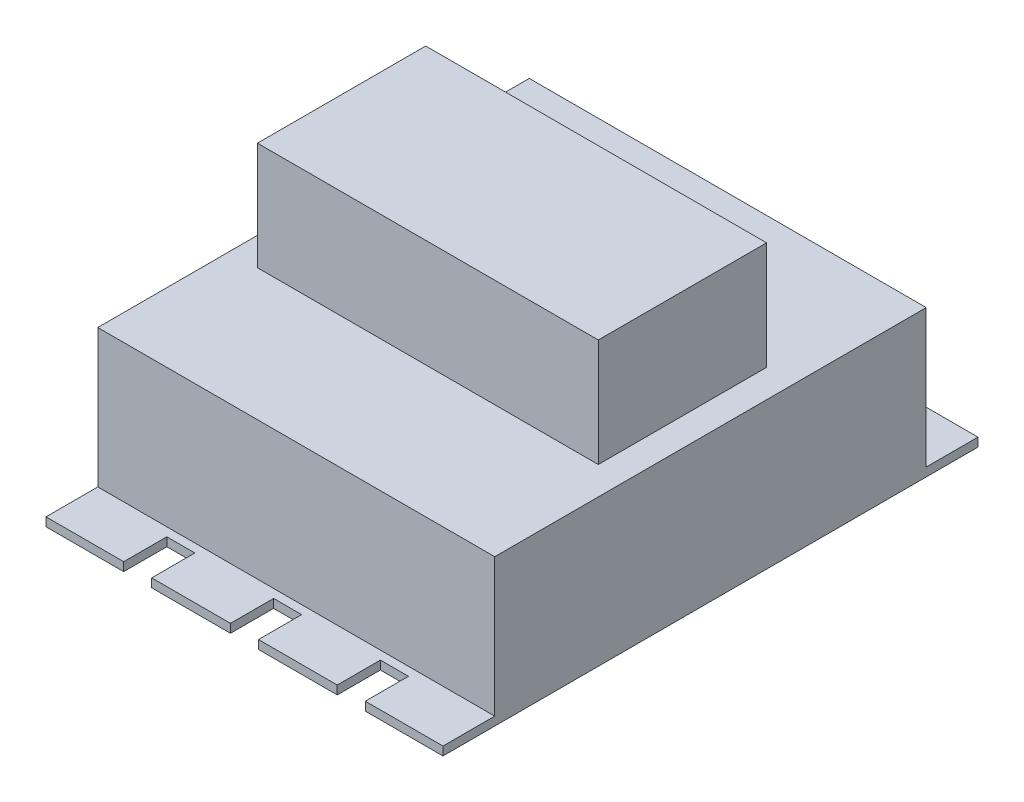
ISO-10303-21;
HEADER;
FILE_DESCRIPTION(('STEP AP214'),'2;1');
FILE_NAME('part.step','',(''),(''),'','','');
FILE_SCHEMA(('AUTOMOTIVE_DESIGN { 1 0 10303 214 1 1 1 1 }'));
ENDSEC;
DATA;
#1=APPLICATION_CONTEXT('core data for automotive mechanical design processes');
#2=APPLICATION_PROTOCOL_DEFINITION('international standard','automotive_design',2000,#1);
#3=PRODUCT_CONTEXT('',#1,'mechanical');
#4=PRODUCT('Part','Part','',(#3));
#5=PRODUCT_RELATED_PRODUCT_CATEGORY('part','',(#4));
#6=PRODUCT_DEFINITION_FORMATION('','',#4);
#7=PRODUCT_DEFINITION_CONTEXT('part definition',#1,'design');
#8=PRODUCT_DEFINITION('design','',#6,#7);
#9=PRODUCT_DEFINITION_SHAPE('','',#8);
#10=(LENGTH_UNIT() NAMED_UNIT(*) SI_UNIT(.MILLI.,.METRE.));
#11=(NAMED_UNIT(*) PLANE_ANGLE_UNIT() SI_UNIT($,.RADIAN.));
#12=(NAMED_UNIT(*) SI_UNIT($,.STERADIAN.) SOLID_ANGLE_UNIT());
#13=UNCERTAINTY_MEASURE_WITH_UNIT(LENGTH_MEASURE(1.E-05),#10,'distance_accuracy_value','');
#14=(GEOMETRIC_REPRESENTATION_CONTEXT(3) GLOBAL_UNCERTAINTY_ASSIGNED_CONTEXT((#13)) GLOBAL_UNIT_ASSIGNED_CONTEXT((#10,
#11,#12)) REPRESENTATION_CONTEXT('',''));
#15=CARTESIAN_POINT('',(0.,0.,0.));
#16=DIRECTION('',(0.,0.,1.));
#17=DIRECTION('',(1.,0.,0.));
#18=AXIS2_PLACEMENT_3D('',#15,#16,#17);
#19=CARTESIAN_POINT('',(0.,34.,0.));
#20=DIRECTION('',(0.,0.,-1.));
#21=DIRECTION('',(-1.,0.,0.));
#22=AXIS2_PLACEMENT_3D('',#19,#20,#21);
#23=PLANE('',#22);
#24=DIRECTION('',(-1.,0.,0.));
#25=VECTOR('',#24,1.);
#26=CARTESIAN_POINT('',(0.,2.,0.));
#27=LINE('',#26,#25);
#28=CARTESIAN_POINT('',(92.,2.,0.));
#29=VERTEX_POINT('',#28);
#30=CARTESIAN_POINT('',(0.,2.,0.));
#31=VERTEX_POINT('',#30);
#32=EDGE_CURVE('E52',#29,#31,#27,.T.);
#33=ORIENTED_EDGE('',*,*,#32,.F.);
#34=DIRECTION('',(0.,-1.,0.));
#35=VECTOR('',#34,1.);
#36=CARTESIAN_POINT('',(92.,34.,0.));
#37=LINE('',#36,#35);
#38=CARTESIAN_POINT('',(92.,34.,0.));
#39=VERTEX_POINT('',#38);
#40=EDGE_CURVE('E552',#39,#29,#37,.T.);
#41=ORIENTED_EDGE('',*,*,#40,.F.);
#42=DIRECTION('',(1.,0.,0.));
#43=VECTOR('',#42,1.);
#44=CARTESIAN_POINT('',(0.,34.,0.));
#45=LINE('',#44,#43);
#46=CARTESIAN_POINT('',(0.,34.,0.));
#47=VERTEX_POINT('',#46);
#48=EDGE_CURVE('E540',#47,#39,#45,.T.);
#49=ORIENTED_EDGE('',*,*,#48,.F.);
#50=DIRECTION('',(0.,-1.,0.));
#51=VECTOR('',#50,1.);
#52=CARTESIAN_POINT('',(0.,34.,0.));
#53=LINE('',#52,#51);
#54=EDGE_CURVE('E42',#47,#31,#53,.T.);
#55=ORIENTED_EDGE('',*,*,#54,.T.);
#56=EDGE_LOOP('',(#33,#41,#49,#55));
#57=FACE_BOUND('',#56,.T.);
#58=ADVANCED_FACE('F34',(#57),#23,.F.);
#59=CARTESIAN_POINT('',(0.,34.,-100.));
#60=DIRECTION('',(0.,0.,1.));
#61=DIRECTION('',(1.,0.,0.));
#62=AXIS2_PLACEMENT_3D('',#59,#60,#61);
#63=PLANE('',#62);
#64=DIRECTION('',(1.,0.,0.));
#65=VECTOR('',#64,1.);
#66=CARTESIAN_POINT('',(0.,2.,-100.));
#67=LINE('',#66,#65);
#68=CARTESIAN_POINT('',(0.,2.,-100.));
#69=VERTEX_POINT('',#68);
#70=CARTESIAN_POINT('',(92.,2.,-100.));
#71=VERTEX_POINT('',#70);
#72=EDGE_CURVE('E11',#69,#71,#67,.T.);
#73=ORIENTED_EDGE('',*,*,#72,.F.);
#74=DIRECTION('',(0.,-1.,0.));
#75=VECTOR('',#74,1.);
#76=CARTESIAN_POINT('',(0.,34.,-100.));
#77=LINE('',#76,#75);
#78=CARTESIAN_POINT('',(0.,34.,-100.));
#79=VERTEX_POINT('',#78);
#80=EDGE_CURVE('E272',#79,#69,#77,.T.);
#81=ORIENTED_EDGE('',*,*,#80,.F.);
#82=DIRECTION('',(-1.,0.,0.));
#83=VECTOR('',#82,1.);
#84=CARTESIAN_POINT('',(0.,34.,-100.));
#85=LINE('',#84,#83);
#86=CARTESIAN_POINT('',(92.,34.,-100.));
#87=VERTEX_POINT('',#86);
#88=EDGE_CURVE('E545',#87,#79,#85,.T.);
#89=ORIENTED_EDGE('',*,*,#88,.F.);
#90=DIRECTION('',(0.,-1.,0.));
#91=VECTOR('',#90,1.);
#92=CARTESIAN_POINT('',(92.,34.,-100.));
#93=LINE('',#92,#91);
#94=EDGE_CURVE('E550',#87,#71,#93,.T.);
#95=ORIENTED_EDGE('',*,*,#94,.T.);
#96=EDGE_LOOP('',(#73,#81,#89,#95));
#97=FACE_BOUND('',#96,.T.);
#98=ADVANCED_FACE('F584',(#97),#63,.F.);
#99=CARTESIAN_POINT('',(0.,34.,0.));
#100=DIRECTION('',(0.,-1.,0.));
#101=DIRECTION('',(0.,0.,-1.));
#102=AXIS2_PLACEMENT_3D('',#99,#100,#101);
#103=PLANE('',#102);
#104=DIRECTION('',(0.,0.,1.));
#105=VECTOR('',#104,1.);
#106=CARTESIAN_POINT('',(0.,34.,0.));
#107=LINE('',#106,#105);
#108=EDGE_CURVE('E537',#79,#47,#107,.T.);
#109=ORIENTED_EDGE('',*,*,#108,.T.);
#110=ORIENTED_EDGE('',*,*,#48,.T.);
#111=DIRECTION('',(0.,0.,-1.));
#112=VECTOR('',#111,1.);
#113=CARTESIAN_POINT('',(92.,34.,0.));
#114=LINE('',#113,#112);
#115=EDGE_CURVE('E543',#39,#87,#114,.T.);
#116=ORIENTED_EDGE('',*,*,#115,.T.);
#117=ORIENTED_EDGE('',*,*,#88,.T.);
#118=EDGE_LOOP('',(#109,#110,#116,#117));
#119=FACE_BOUND('',#118,.T.);
#120=DIRECTION('',(0.,0.,1.));
#121=VECTOR('',#120,1.);
#122=CARTESIAN_POINT('',(6.50000000000001,34.,-69.5));
#123=LINE('',#122,#121);
#124=CARTESIAN_POINT('',(6.50000000000001,34.,-69.5));
#125=VERTEX_POINT('',#124);
#126=CARTESIAN_POINT('',(6.50000000000001,34.,-30.5));
#127=VERTEX_POINT('',#126);
#128=EDGE_CURVE('E503',#125,#127,#123,.T.);
#129=ORIENTED_EDGE('',*,*,#128,.F.);
#130=DIRECTION('',(-1.,0.,0.));
#131=VECTOR('',#130,1.);
#132=CARTESIAN_POINT('',(6.50000000000001,34.,-69.5));
#133=LINE('',#132,#131);
#134=CARTESIAN_POINT('',(85.5,34.,-69.5));
#135=VERTEX_POINT('',#134);
#136=EDGE_CURVE('E508',#135,#125,#133,.T.);
#137=ORIENTED_EDGE('',*,*,#136,.F.);
#138=DIRECTION('',(0.,0.,-1.));
#139=VECTOR('',#138,1.);
#140=CARTESIAN_POINT('',(85.5,34.,-69.5));
#141=LINE('',#140,#139);
#142=CARTESIAN_POINT('',(85.5,34.,-30.5));
#143=VERTEX_POINT('',#142);
#144=EDGE_CURVE('E520',#143,#135,#141,.T.);
#145=ORIENTED_EDGE('',*,*,#144,.F.);
#146=DIRECTION('',(1.,0.,0.));
#147=VECTOR('',#146,1.);
#148=CARTESIAN_POINT('',(6.50000000000001,34.,-30.5));
#149=LINE('',#148,#147);
#150=EDGE_CURVE('E517',#127,#143,#149,.T.);
#151=ORIENTED_EDGE('',*,*,#150,.F.);
#152=EDGE_LOOP('',(#129,#137,#145,#151));
#153=FACE_BOUND('',#152,.T.);
#154=ADVANCED_FACE('F586',(#119,#153),#103,.F.);
#155=CARTESIAN_POINT('',(0.,34.,0.));
#156=DIRECTION('',(1.,0.,0.));
#157=DIRECTION('',(0.,0.,-1.));
#158=AXIS2_PLACEMENT_3D('',#155,#156,#157);
#159=PLANE('',#158);
#160=DIRECTION('',(0.,0.,1.));
#161=VECTOR('',#160,1.);
#162=CARTESIAN_POINT('',(0.,0.,0.));
#163=LINE('',#162,#161);
#164=CARTESIAN_POINT('',(0.,0.,-112.));
#165=VERTEX_POINT('',#164);
#166=CARTESIAN_POINT('',(0.,0.,12.));
#167=VERTEX_POINT('',#166);
#168=EDGE_CURVE('E536',#165,#167,#163,.T.);
#169=ORIENTED_EDGE('',*,*,#168,.T.);
#170=DIRECTION('',(0.,-1.,0.));
#171=VECTOR('',#170,1.);
#172=CARTESIAN_POINT('',(0.,2.,12.));
#173=LINE('',#172,#171);
#174=CARTESIAN_POINT('',(0.,2.,12.));
#175=VERTEX_POINT('',#174);
#176=EDGE_CURVE('E446',#175,#167,#173,.T.);
#177=ORIENTED_EDGE('',*,*,#176,.F.);
#178=DIRECTION('',(0.,0.,-1.));
#179=VECTOR('',#178,1.);
#180=CARTESIAN_POINT('',(0.,2.,12.));
#181=LINE('',#180,#179);
#182=EDGE_CURVE('E275',#175,#31,#181,.T.);
#183=ORIENTED_EDGE('',*,*,#182,.T.);
#184=ORIENTED_EDGE('',*,*,#54,.F.);
#185=ORIENTED_EDGE('',*,*,#108,.F.);
#186=ORIENTED_EDGE('',*,*,#80,.T.);
#187=CARTESIAN_POINT('',(0.,2.,-112.));
#188=VERTEX_POINT('',#187);
#189=EDGE_CURVE('E266',#69,#188,#181,.T.);
#190=ORIENTED_EDGE('',*,*,#189,.T.);
#191=DIRECTION('',(0.,-1.,0.));
#192=VECTOR('',#191,1.);
#193=CARTESIAN_POINT('',(0.,2.,-112.));
#194=LINE('',#193,#192);
#195=EDGE_CURVE('E268',#188,#165,#194,.T.);
#196=ORIENTED_EDGE('',*,*,#195,.T.);
#197=EDGE_LOOP('',(#169,#177,#183,#184,#185,#186,#190,#196));
#198=FACE_BOUND('',#197,.T.);
#199=ADVANCED_FACE('F36',(#198),#159,.F.);
#200=CARTESIAN_POINT('',(92.,34.,0.));
#201=DIRECTION('',(-1.,0.,0.));
#202=DIRECTION('',(0.,0.,1.));
#203=AXIS2_PLACEMENT_3D('',#200,#201,#202);
#204=PLANE('',#203);
#205=DIRECTION('',(0.,0.,-1.));
#206=VECTOR('',#205,1.);
#207=CARTESIAN_POINT('',(92.,0.,0.));
#208=LINE('',#207,#206);
#209=CARTESIAN_POINT('',(92.,0.,12.));
#210=VERTEX_POINT('',#209);
#211=CARTESIAN_POINT('',(92.,0.,-112.));
#212=VERTEX_POINT('',#211);
#213=EDGE_CURVE('E541',#210,#212,#208,.T.);
#214=ORIENTED_EDGE('',*,*,#213,.T.);
#215=DIRECTION('',(0.,-1.,0.));
#216=VECTOR('',#215,1.);
#217=CARTESIAN_POINT('',(92.,2.,-112.));
#218=LINE('',#217,#216);
#219=CARTESIAN_POINT('',(92.,2.,-112.));
#220=VERTEX_POINT('',#219);
#221=EDGE_CURVE('E476',#220,#212,#218,.T.);
#222=ORIENTED_EDGE('',*,*,#221,.F.);
#223=DIRECTION('',(0.,0.,1.));
#224=VECTOR('',#223,1.);
#225=CARTESIAN_POINT('',(92.,2.,12.));
#226=LINE('',#225,#224);
#227=EDGE_CURVE('E330',#220,#71,#226,.T.);
#228=ORIENTED_EDGE('',*,*,#227,.T.);
#229=ORIENTED_EDGE('',*,*,#94,.F.);
#230=ORIENTED_EDGE('',*,*,#115,.F.);
#231=ORIENTED_EDGE('',*,*,#40,.T.);
#232=CARTESIAN_POINT('',(92.,2.,12.));
#233=VERTEX_POINT('',#232);
#234=EDGE_CURVE('E329',#29,#233,#226,.T.);
#235=ORIENTED_EDGE('',*,*,#234,.T.);
#236=DIRECTION('',(0.,-1.,0.));
#237=VECTOR('',#236,1.);
#238=CARTESIAN_POINT('',(92.,2.,12.));
#239=LINE('',#238,#237);
#240=EDGE_CURVE('E473',#233,#210,#239,.T.);
#241=ORIENTED_EDGE('',*,*,#240,.T.);
#242=EDGE_LOOP('',(#214,#222,#228,#229,#230,#231,#235,#241));
#243=FACE_BOUND('',#242,.T.);
#244=ADVANCED_FACE('F556',(#243),#204,.F.);
#245=CARTESIAN_POINT('',(0.,0.,0.));
#246=DIRECTION('',(0.,-1.,0.));
#247=DIRECTION('',(0.,0.,-1.));
#248=AXIS2_PLACEMENT_3D('',#245,#246,#247);
#249=PLANE('',#248);
#250=ORIENTED_EDGE('',*,*,#168,.F.);
#251=DIRECTION('',(1.,0.,0.));
#252=VECTOR('',#251,1.);
#253=CARTESIAN_POINT('',(0.,0.,-112.));
#254=LINE('',#253,#252);
#255=CARTESIAN_POINT('',(18.,0.,-112.));
#256=VERTEX_POINT('',#255);
#257=EDGE_CURVE('E283',#165,#256,#254,.T.);
#258=ORIENTED_EDGE('',*,*,#257,.T.);
#259=DIRECTION('',(0.,0.,1.));
#260=VECTOR('',#259,1.);
#261=CARTESIAN_POINT('',(18.,0.,-112.));
#262=LINE('',#261,#260);
#263=CARTESIAN_POINT('',(18.,0.,-102.));
#264=VERTEX_POINT('',#263);
#265=EDGE_CURVE('E372',#256,#264,#262,.T.);
#266=ORIENTED_EDGE('',*,*,#265,.T.);
#267=DIRECTION('',(1.,0.,0.));
#268=VECTOR('',#267,1.);
#269=CARTESIAN_POINT('',(18.,0.,-102.));
#270=LINE('',#269,#268);
#271=CARTESIAN_POINT('',(24.5,0.,-102.));
#272=VERTEX_POINT('',#271);
#273=EDGE_CURVE('E375',#264,#272,#270,.T.);
#274=ORIENTED_EDGE('',*,*,#273,.T.);
#275=DIRECTION('',(0.,0.,-1.));
#276=VECTOR('',#275,1.);
#277=CARTESIAN_POINT('',(24.5,0.,-112.));
#278=LINE('',#277,#276);
#279=CARTESIAN_POINT('',(24.5,0.,-112.));
#280=VERTEX_POINT('',#279);
#281=EDGE_CURVE('E378',#272,#280,#278,.T.);
#282=ORIENTED_EDGE('',*,*,#281,.T.);
#283=DIRECTION('',(1.,0.,0.));
#284=VECTOR('',#283,1.);
#285=CARTESIAN_POINT('',(24.5,0.,-112.));
#286=LINE('',#285,#284);
#287=CARTESIAN_POINT('',(42.75,0.,-112.));
#288=VERTEX_POINT('',#287);
#289=EDGE_CURVE('E381',#280,#288,#286,.T.);
#290=ORIENTED_EDGE('',*,*,#289,.T.);
#291=DIRECTION('',(0.,0.,1.));
#292=VECTOR('',#291,1.);
#293=CARTESIAN_POINT('',(42.75,0.,-112.));
#294=LINE('',#293,#292);
#295=CARTESIAN_POINT('',(42.75,0.,-102.));
#296=VERTEX_POINT('',#295);
#297=EDGE_CURVE('E384',#288,#296,#294,.T.);
#298=ORIENTED_EDGE('',*,*,#297,.T.);
#299=DIRECTION('',(1.,0.,0.));
#300=VECTOR('',#299,1.);
#301=CARTESIAN_POINT('',(42.75,0.,-102.));
#302=LINE('',#301,#300);
#303=CARTESIAN_POINT('',(49.25,0.,-102.));
#304=VERTEX_POINT('',#303);
#305=EDGE_CURVE('E387',#296,#304,#302,.T.);
#306=ORIENTED_EDGE('',*,*,#305,.T.);
#307=DIRECTION('',(0.,0.,-1.));
#308=VECTOR('',#307,1.);
#309=CARTESIAN_POINT('',(49.25,0.,-112.));
#310=LINE('',#309,#308);
#311=CARTESIAN_POINT('',(49.25,0.,-112.));
#312=VERTEX_POINT('',#311);
#313=EDGE_CURVE('E390',#304,#312,#310,.T.);
#314=ORIENTED_EDGE('',*,*,#313,.T.);
#315=DIRECTION('',(1.,0.,0.));
#316=VECTOR('',#315,1.);
#317=CARTESIAN_POINT('',(49.25,0.,-112.));
#318=LINE('',#317,#316);
#319=CARTESIAN_POINT('',(67.5,0.,-112.));
#320=VERTEX_POINT('',#319);
#321=EDGE_CURVE('E393',#312,#320,#318,.T.);
#322=ORIENTED_EDGE('',*,*,#321,.T.);
#323=DIRECTION('',(0.,0.,1.));
#324=VECTOR('',#323,1.);
#325=CARTESIAN_POINT('',(67.5,0.,-112.));
#326=LINE('',#325,#324);
#327=CARTESIAN_POINT('',(67.5,0.,-102.));
#328=VERTEX_POINT('',#327);
#329=EDGE_CURVE('E396',#320,#328,#326,.T.);
#330=ORIENTED_EDGE('',*,*,#329,.T.);
#331=DIRECTION('',(1.,0.,0.));
#332=VECTOR('',#331,1.);
#333=CARTESIAN_POINT('',(74.,0.,-102.));
#334=LINE('',#333,#332);
#335=CARTESIAN_POINT('',(74.,0.,-102.));
#336=VERTEX_POINT('',#335);
#337=EDGE_CURVE('E399',#328,#336,#334,.T.);
#338=ORIENTED_EDGE('',*,*,#337,.T.);
#339=DIRECTION('',(0.,0.,-1.));
#340=VECTOR('',#339,1.);
#341=CARTESIAN_POINT('',(74.,0.,-112.));
#342=LINE('',#341,#340);
#343=CARTESIAN_POINT('',(74.,0.,-112.));
#344=VERTEX_POINT('',#343);
#345=EDGE_CURVE('E402',#336,#344,#342,.T.);
#346=ORIENTED_EDGE('',*,*,#345,.T.);
#347=DIRECTION('',(1.,0.,0.));
#348=VECTOR('',#347,1.);
#349=CARTESIAN_POINT('',(74.,0.,-112.));
#350=LINE('',#349,#348);
#351=EDGE_CURVE('E405',#344,#212,#350,.T.);
#352=ORIENTED_EDGE('',*,*,#351,.T.);
#353=ORIENTED_EDGE('',*,*,#213,.F.);
#354=DIRECTION('',(-1.,0.,0.));
#355=VECTOR('',#354,1.);
#356=CARTESIAN_POINT('',(74.,0.,12.));
#357=LINE('',#356,#355);
#358=CARTESIAN_POINT('',(74.,0.,12.));
#359=VERTEX_POINT('',#358);
#360=EDGE_CURVE('E408',#210,#359,#357,.T.);
#361=ORIENTED_EDGE('',*,*,#360,.T.);
#362=DIRECTION('',(0.,0.,-1.));
#363=VECTOR('',#362,1.);
#364=CARTESIAN_POINT('',(74.,0.,12.));
#365=LINE('',#364,#363);
#366=CARTESIAN_POINT('',(74.,0.,2.));
#367=VERTEX_POINT('',#366);
#368=EDGE_CURVE('E411',#359,#367,#365,.T.);
#369=ORIENTED_EDGE('',*,*,#368,.T.);
#370=DIRECTION('',(-1.,0.,0.));
#371=VECTOR('',#370,1.);
#372=CARTESIAN_POINT('',(74.,0.,2.));
#373=LINE('',#372,#371);
#374=CARTESIAN_POINT('',(67.5,0.,2.));
#375=VERTEX_POINT('',#374);
#376=EDGE_CURVE('E414',#367,#375,#373,.T.);
#377=ORIENTED_EDGE('',*,*,#376,.T.);
#378=DIRECTION('',(0.,0.,1.));
#379=VECTOR('',#378,1.);
#380=CARTESIAN_POINT('',(67.5,0.,12.));
#381=LINE('',#380,#379);
#382=CARTESIAN_POINT('',(67.5,0.,12.));
#383=VERTEX_POINT('',#382);
#384=EDGE_CURVE('E417',#375,#383,#381,.T.);
#385=ORIENTED_EDGE('',*,*,#384,.T.);
#386=DIRECTION('',(-1.,0.,0.));
#387=VECTOR('',#386,1.);
#388=CARTESIAN_POINT('',(49.25,0.,12.));
#389=LINE('',#388,#387);
#390=CARTESIAN_POINT('',(49.25,0.,12.));
#391=VERTEX_POINT('',#390);
#392=EDGE_CURVE('E420',#383,#391,#389,.T.);
#393=ORIENTED_EDGE('',*,*,#392,.T.);
#394=DIRECTION('',(0.,0.,-1.));
#395=VECTOR('',#394,1.);
#396=CARTESIAN_POINT('',(49.25,0.,12.));
#397=LINE('',#396,#395);
#398=CARTESIAN_POINT('',(49.25,0.,2.));
#399=VERTEX_POINT('',#398);
#400=EDGE_CURVE('E423',#391,#399,#397,.T.);
#401=ORIENTED_EDGE('',*,*,#400,.T.);
#402=DIRECTION('',(-1.,0.,0.));
#403=VECTOR('',#402,1.);
#404=CARTESIAN_POINT('',(42.75,0.,2.));
#405=LINE('',#404,#403);
#406=CARTESIAN_POINT('',(42.75,0.,2.));
#407=VERTEX_POINT('',#406);
#408=EDGE_CURVE('E426',#399,#407,#405,.T.);
#409=ORIENTED_EDGE('',*,*,#408,.T.);
#410=DIRECTION('',(0.,0.,1.));
#411=VECTOR('',#410,1.);
#412=CARTESIAN_POINT('',(42.75,0.,12.));
#413=LINE('',#412,#411);
#414=CARTESIAN_POINT('',(42.75,0.,12.));
#415=VERTEX_POINT('',#414);
#416=EDGE_CURVE('E429',#407,#415,#413,.T.);
#417=ORIENTED_EDGE('',*,*,#416,.T.);
#418=DIRECTION('',(-1.,0.,0.));
#419=VECTOR('',#418,1.);
#420=CARTESIAN_POINT('',(24.5,0.,12.));
#421=LINE('',#420,#419);
#422=CARTESIAN_POINT('',(24.5,0.,12.));
#423=VERTEX_POINT('',#422);
#424=EDGE_CURVE('E432',#415,#423,#421,.T.);
#425=ORIENTED_EDGE('',*,*,#424,.T.);
#426=DIRECTION('',(0.,0.,-1.));
#427=VECTOR('',#426,1.);
#428=CARTESIAN_POINT('',(24.5,0.,12.));
#429=LINE('',#428,#427);
#430=CARTESIAN_POINT('',(24.5,0.,2.));
#431=VERTEX_POINT('',#430);
#432=EDGE_CURVE('E435',#423,#431,#429,.T.);
#433=ORIENTED_EDGE('',*,*,#432,.T.);
#434=DIRECTION('',(-1.,0.,0.));
#435=VECTOR('',#434,1.);
#436=CARTESIAN_POINT('',(18.,0.,2.));
#437=LINE('',#436,#435);
#438=CARTESIAN_POINT('',(18.,0.,2.));
#439=VERTEX_POINT('',#438);
#440=EDGE_CURVE('E438',#431,#439,#437,.T.);
#441=ORIENTED_EDGE('',*,*,#440,.T.);
#442=DIRECTION('',(0.,0.,1.));
#443=VECTOR('',#442,1.);
#444=CARTESIAN_POINT('',(18.,0.,12.));
#445=LINE('',#444,#443);
#446=CARTESIAN_POINT('',(18.,0.,12.));
#447=VERTEX_POINT('',#446);
#448=EDGE_CURVE('E441',#439,#447,#445,.T.);
#449=ORIENTED_EDGE('',*,*,#448,.T.);
#450=DIRECTION('',(-1.,0.,0.));
#451=VECTOR('',#450,1.);
#452=CARTESIAN_POINT('',(0.,0.,12.));
#453=LINE('',#452,#451);
#454=EDGE_CURVE('E276',#447,#167,#453,.T.);
#455=ORIENTED_EDGE('',*,*,#454,.T.);
#456=EDGE_LOOP('',(#250,#258,#266,#274,#282,#290,#298,#306,#314,#322,#330,#338,#346,#352,#353,
#361,#369,#377,#385,#393,#401,#409,#417,#425,#433,#441,#449,#455));
#457=FACE_BOUND('',#456,.T.);
#458=ADVANCED_FACE('F575',(#457),#249,.T.);
#459=CARTESIAN_POINT('',(6.50000000000001,59.,-69.5));
#460=DIRECTION('',(1.,0.,0.));
#461=DIRECTION('',(0.,0.,-1.));
#462=AXIS2_PLACEMENT_3D('',#459,#460,#461);
#463=PLANE('',#462);
#464=ORIENTED_EDGE('',*,*,#128,.T.);
#465=DIRECTION('',(0.,-1.,0.));
#466=VECTOR('',#465,1.);
#467=CARTESIAN_POINT('',(6.50000000000001,59.,-30.5));
#468=LINE('',#467,#466);
#469=CARTESIAN_POINT('',(6.50000000000001,59.,-30.5));
#470=VERTEX_POINT('',#469);
#471=EDGE_CURVE('E533',#470,#127,#468,.T.);
#472=ORIENTED_EDGE('',*,*,#471,.F.);
#473=DIRECTION('',(0.,0.,1.));
#474=VECTOR('',#473,1.);
#475=CARTESIAN_POINT('',(6.50000000000001,59.,-69.5));
#476=LINE('',#475,#474);
#477=CARTESIAN_POINT('',(6.50000000000001,59.,-69.5));
#478=VERTEX_POINT('',#477);
#479=EDGE_CURVE('E504',#478,#470,#476,.T.);
#480=ORIENTED_EDGE('',*,*,#479,.F.);
#481=DIRECTION('',(0.,-1.,0.));
#482=VECTOR('',#481,1.);
#483=CARTESIAN_POINT('',(6.50000000000001,59.,-69.5));
#484=LINE('',#483,#482);
#485=EDGE_CURVE('E514',#478,#125,#484,.T.);
#486=ORIENTED_EDGE('',*,*,#485,.T.);
#487=EDGE_LOOP('',(#464,#472,#480,#486));
#488=FACE_BOUND('',#487,.T.);
#489=ADVANCED_FACE('F598',(#488),#463,.F.);
#490=CARTESIAN_POINT('',(6.50000000000001,59.,-30.5));
#491=DIRECTION('',(0.,0.,-1.));
#492=DIRECTION('',(-1.,0.,0.));
#493=AXIS2_PLACEMENT_3D('',#490,#491,#492);
#494=PLANE('',#493);
#495=ORIENTED_EDGE('',*,*,#150,.T.);
#496=DIRECTION('',(0.,-1.,0.));
#497=VECTOR('',#496,1.);
#498=CARTESIAN_POINT('',(85.5,59.,-30.5));
#499=LINE('',#498,#497);
#500=CARTESIAN_POINT('',(85.5,59.,-30.5));
#501=VERTEX_POINT('',#500);
#502=EDGE_CURVE('E530',#501,#143,#499,.T.);
#503=ORIENTED_EDGE('',*,*,#502,.F.);
#504=DIRECTION('',(1.,0.,0.));
#505=VECTOR('',#504,1.);
#506=CARTESIAN_POINT('',(6.50000000000001,59.,-30.5));
#507=LINE('',#506,#505);
#508=EDGE_CURVE('E507',#470,#501,#507,.T.);
#509=ORIENTED_EDGE('',*,*,#508,.F.);
#510=ORIENTED_EDGE('',*,*,#471,.T.);
#511=EDGE_LOOP('',(#495,#503,#509,#510));
#512=FACE_BOUND('',#511,.T.);
#513=ADVANCED_FACE('F603',(#512),#494,.F.);
#514=CARTESIAN_POINT('',(85.5,59.,-69.5));
#515=DIRECTION('',(-1.,0.,0.));
#516=DIRECTION('',(0.,0.,1.));
#517=AXIS2_PLACEMENT_3D('',#514,#515,#516);
#518=PLANE('',#517);
#519=ORIENTED_EDGE('',*,*,#144,.T.);
#520=DIRECTION('',(0.,-1.,0.));
#521=VECTOR('',#520,1.);
#522=CARTESIAN_POINT('',(85.5,59.,-69.5));
#523=LINE('',#522,#521);
#524=CARTESIAN_POINT('',(85.5,59.,-69.5));
#525=VERTEX_POINT('',#524);
#526=EDGE_CURVE('E527',#525,#135,#523,.T.);
#527=ORIENTED_EDGE('',*,*,#526,.F.);
#528=DIRECTION('',(0.,0.,-1.));
#529=VECTOR('',#528,1.);
#530=CARTESIAN_POINT('',(85.5,59.,-69.5));
#531=LINE('',#530,#529);
#532=EDGE_CURVE('E510',#501,#525,#531,.T.);
#533=ORIENTED_EDGE('',*,*,#532,.F.);
#534=ORIENTED_EDGE('',*,*,#502,.T.);
#535=EDGE_LOOP('',(#519,#527,#533,#534));
#536=FACE_BOUND('',#535,.T.);
#537=ADVANCED_FACE('F607',(#536),#518,.F.);
#538=CARTESIAN_POINT('',(6.50000000000001,59.,-69.5));
#539=DIRECTION('',(0.,0.,1.));
#540=DIRECTION('',(1.,0.,0.));
#541=AXIS2_PLACEMENT_3D('',#538,#539,#540);
#542=PLANE('',#541);
#543=ORIENTED_EDGE('',*,*,#136,.T.);
#544=ORIENTED_EDGE('',*,*,#485,.F.);
#545=DIRECTION('',(-1.,0.,0.));
#546=VECTOR('',#545,1.);
#547=CARTESIAN_POINT('',(6.50000000000001,59.,-69.5));
#548=LINE('',#547,#546);
#549=EDGE_CURVE('E512',#525,#478,#548,.T.);
#550=ORIENTED_EDGE('',*,*,#549,.F.);
#551=ORIENTED_EDGE('',*,*,#526,.T.);
#552=EDGE_LOOP('',(#543,#544,#550,#551));
#553=FACE_BOUND('',#552,.T.);
#554=ADVANCED_FACE('F611',(#553),#542,.F.);
#555=CARTESIAN_POINT('',(0.,59.,0.));
#556=DIRECTION('',(0.,1.,0.));
#557=DIRECTION('',(0.,0.,1.));
#558=AXIS2_PLACEMENT_3D('',#555,#556,#557);
#559=PLANE('',#558);
#560=ORIENTED_EDGE('',*,*,#479,.T.);
#561=ORIENTED_EDGE('',*,*,#508,.T.);
#562=ORIENTED_EDGE('',*,*,#532,.T.);
#563=ORIENTED_EDGE('',*,*,#549,.T.);
#564=EDGE_LOOP('',(#560,#561,#562,#563));
#565=FACE_BOUND('',#564,.T.);
#566=ADVANCED_FACE('F615',(#565),#559,.T.);
#567=CARTESIAN_POINT('',(74.,2.,-112.));
#568=DIRECTION('',(0.,0.,-1.));
#569=DIRECTION('',(-1.,0.,0.));
#570=AXIS2_PLACEMENT_3D('',#567,#568,#569);
#571=PLANE('',#570);
#572=ORIENTED_EDGE('',*,*,#351,.F.);
#573=DIRECTION('',(0.,-1.,0.));
#574=VECTOR('',#573,1.);
#575=CARTESIAN_POINT('',(74.,2.,-112.));
#576=LINE('',#575,#574);
#577=CARTESIAN_POINT('',(74.,2.,-112.));
#578=VERTEX_POINT('',#577);
#579=EDGE_CURVE('E479',#578,#344,#576,.T.);
#580=ORIENTED_EDGE('',*,*,#579,.F.);
#581=DIRECTION('',(1.,0.,0.));
#582=VECTOR('',#581,1.);
#583=CARTESIAN_POINT('',(74.,2.,-112.));
#584=LINE('',#583,#582);
#585=EDGE_CURVE('E326',#578,#220,#584,.T.);
#586=ORIENTED_EDGE('',*,*,#585,.T.);
#587=ORIENTED_EDGE('',*,*,#221,.T.);
#588=EDGE_LOOP('',(#572,#580,#586,#587));
#589=FACE_BOUND('',#588,.T.);
#590=ADVANCED_FACE('F573',(#589),#571,.T.);
#591=CARTESIAN_POINT('',(74.,2.,-112.));
#592=DIRECTION('',(-1.,0.,0.));
#593=DIRECTION('',(0.,0.,1.));
#594=AXIS2_PLACEMENT_3D('',#591,#592,#593);
#595=PLANE('',#594);
#596=ORIENTED_EDGE('',*,*,#345,.F.);
#597=DIRECTION('',(0.,-1.,0.));
#598=VECTOR('',#597,1.);
#599=CARTESIAN_POINT('',(74.,2.,-102.));
#600=LINE('',#599,#598);
#601=CARTESIAN_POINT('',(74.,2.,-102.));
#602=VERTEX_POINT('',#601);
#603=EDGE_CURVE('E481',#602,#336,#600,.T.);
#604=ORIENTED_EDGE('',*,*,#603,.F.);
#605=DIRECTION('',(0.,0.,-1.));
#606=VECTOR('',#605,1.);
#607=CARTESIAN_POINT('',(74.,2.,-112.));
#608=LINE('',#607,#606);
#609=EDGE_CURVE('E323',#602,#578,#608,.T.);
#610=ORIENTED_EDGE('',*,*,#609,.T.);
#611=ORIENTED_EDGE('',*,*,#579,.T.);
#612=EDGE_LOOP('',(#596,#604,#610,#611));
#613=FACE_BOUND('',#612,.T.);
#614=ADVANCED_FACE('F579',(#613),#595,.T.);
#615=CARTESIAN_POINT('',(74.,2.,-102.));
#616=DIRECTION('',(0.,0.,-1.));
#617=DIRECTION('',(-1.,0.,0.));
#618=AXIS2_PLACEMENT_3D('',#615,#616,#617);
#619=PLANE('',#618);
#620=ORIENTED_EDGE('',*,*,#337,.F.);
#621=DIRECTION('',(0.,-1.,0.));
#622=VECTOR('',#621,1.);
#623=CARTESIAN_POINT('',(67.5,2.,-102.));
#624=LINE('',#623,#622);
#625=CARTESIAN_POINT('',(67.5,2.,-102.));
#626=VERTEX_POINT('',#625);
#627=EDGE_CURVE('E483',#626,#328,#624,.T.);
#628=ORIENTED_EDGE('',*,*,#627,.F.);
#629=DIRECTION('',(1.,0.,0.));
#630=VECTOR('',#629,1.);
#631=CARTESIAN_POINT('',(74.,2.,-102.));
#632=LINE('',#631,#630);
#633=EDGE_CURVE('E320',#626,#602,#632,.T.);
#634=ORIENTED_EDGE('',*,*,#633,.T.);
#635=ORIENTED_EDGE('',*,*,#603,.T.);
#636=EDGE_LOOP('',(#620,#628,#634,#635));
#637=FACE_BOUND('',#636,.T.);
#638=ADVANCED_FACE('F657',(#637),#619,.T.);
#639=CARTESIAN_POINT('',(67.5,2.,-112.));
#640=DIRECTION('',(1.,0.,0.));
#641=DIRECTION('',(0.,0.,-1.));
#642=AXIS2_PLACEMENT_3D('',#639,#640,#641);
#643=PLANE('',#642);
#644=ORIENTED_EDGE('',*,*,#329,.F.);
#645=DIRECTION('',(0.,-1.,0.));
#646=VECTOR('',#645,1.);
#647=CARTESIAN_POINT('',(67.5,2.,-112.));
#648=LINE('',#647,#646);
#649=CARTESIAN_POINT('',(67.5,2.,-112.));
#650=VERTEX_POINT('',#649);
#651=EDGE_CURVE('E485',#650,#320,#648,.T.);
#652=ORIENTED_EDGE('',*,*,#651,.F.);
#653=DIRECTION('',(0.,0.,1.));
#654=VECTOR('',#653,1.);
#655=CARTESIAN_POINT('',(67.5,2.,-112.));
#656=LINE('',#655,#654);
#657=EDGE_CURVE('E317',#650,#626,#656,.T.);
#658=ORIENTED_EDGE('',*,*,#657,.T.);
#659=ORIENTED_EDGE('',*,*,#627,.T.);
#660=EDGE_LOOP('',(#644,#652,#658,#659));
#661=FACE_BOUND('',#660,.T.);
#662=ADVANCED_FACE('F653',(#661),#643,.T.);
#663=CARTESIAN_POINT('',(49.25,2.,-112.));
#664=DIRECTION('',(0.,0.,-1.));
#665=DIRECTION('',(-1.,0.,0.));
#666=AXIS2_PLACEMENT_3D('',#663,#664,#665);
#667=PLANE('',#666);
#668=ORIENTED_EDGE('',*,*,#321,.F.);
#669=DIRECTION('',(0.,-1.,0.));
#670=VECTOR('',#669,1.);
#671=CARTESIAN_POINT('',(49.25,2.,-112.));
#672=LINE('',#671,#670);
#673=CARTESIAN_POINT('',(49.25,2.,-112.));
#674=VERTEX_POINT('',#673);
#675=EDGE_CURVE('E487',#674,#312,#672,.T.);
#676=ORIENTED_EDGE('',*,*,#675,.F.);
#677=DIRECTION('',(1.,0.,0.));
#678=VECTOR('',#677,1.);
#679=CARTESIAN_POINT('',(49.25,2.,-112.));
#680=LINE('',#679,#678);
#681=EDGE_CURVE('E314',#674,#650,#680,.T.);
#682=ORIENTED_EDGE('',*,*,#681,.T.);
#683=ORIENTED_EDGE('',*,*,#651,.T.);
#684=EDGE_LOOP('',(#668,#676,#682,#683));
#685=FACE_BOUND('',#684,.T.);
#686=ADVANCED_FACE('F649',(#685),#667,.T.);
#687=CARTESIAN_POINT('',(49.25,2.,-112.));
#688=DIRECTION('',(-1.,0.,0.));
#689=DIRECTION('',(0.,0.,1.));
#690=AXIS2_PLACEMENT_3D('',#687,#688,#689);
#691=PLANE('',#690);
#692=ORIENTED_EDGE('',*,*,#313,.F.);
#693=DIRECTION('',(0.,-1.,0.));
#694=VECTOR('',#693,1.);
#695=CARTESIAN_POINT('',(49.25,2.,-102.));
#696=LINE('',#695,#694);
#697=CARTESIAN_POINT('',(49.25,2.,-102.));
#698=VERTEX_POINT('',#697);
#699=EDGE_CURVE('E489',#698,#304,#696,.T.);
#700=ORIENTED_EDGE('',*,*,#699,.F.);
#701=DIRECTION('',(0.,0.,-1.));
#702=VECTOR('',#701,1.);
#703=CARTESIAN_POINT('',(49.25,2.,-112.));
#704=LINE('',#703,#702);
#705=EDGE_CURVE('E311',#698,#674,#704,.T.);
#706=ORIENTED_EDGE('',*,*,#705,.T.);
#707=ORIENTED_EDGE('',*,*,#675,.T.);
#708=EDGE_LOOP('',(#692,#700,#706,#707));
#709=FACE_BOUND('',#708,.T.);
#710=ADVANCED_FACE('F645',(#709),#691,.T.);
#711=CARTESIAN_POINT('',(42.75,2.,-102.));
#712=DIRECTION('',(0.,0.,-1.));
#713=DIRECTION('',(-1.,0.,0.));
#714=AXIS2_PLACEMENT_3D('',#711,#712,#713);
#715=PLANE('',#714);
#716=ORIENTED_EDGE('',*,*,#305,.F.);
#717=DIRECTION('',(0.,-1.,0.));
#718=VECTOR('',#717,1.);
#719=CARTESIAN_POINT('',(42.75,2.,-102.));
#720=LINE('',#719,#718);
#721=CARTESIAN_POINT('',(42.75,2.,-102.));
#722=VERTEX_POINT('',#721);
#723=EDGE_CURVE('E491',#722,#296,#720,.T.);
#724=ORIENTED_EDGE('',*,*,#723,.F.);
#725=DIRECTION('',(1.,0.,0.));
#726=VECTOR('',#725,1.);
#727=CARTESIAN_POINT('',(42.75,2.,-102.));
#728=LINE('',#727,#726);
#729=EDGE_CURVE('E308',#722,#698,#728,.T.);
#730=ORIENTED_EDGE('',*,*,#729,.T.);
#731=ORIENTED_EDGE('',*,*,#699,.T.);
#732=EDGE_LOOP('',(#716,#724,#730,#731));
#733=FACE_BOUND('',#732,.T.);
#734=ADVANCED_FACE('F641',(#733),#715,.T.);
#735=CARTESIAN_POINT('',(42.75,2.,-112.));
#736=DIRECTION('',(1.,0.,0.));
#737=DIRECTION('',(0.,0.,-1.));
#738=AXIS2_PLACEMENT_3D('',#735,#736,#737);
#739=PLANE('',#738);
#740=ORIENTED_EDGE('',*,*,#297,.F.);
#741=DIRECTION('',(0.,-1.,0.));
#742=VECTOR('',#741,1.);
#743=CARTESIAN_POINT('',(42.75,2.,-112.));
#744=LINE('',#743,#742);
#745=CARTESIAN_POINT('',(42.75,2.,-112.));
#746=VERTEX_POINT('',#745);
#747=EDGE_CURVE('E493',#746,#288,#744,.T.);
#748=ORIENTED_EDGE('',*,*,#747,.F.);
#749=DIRECTION('',(0.,0.,1.));
#750=VECTOR('',#749,1.);
#751=CARTESIAN_POINT('',(42.75,2.,-112.));
#752=LINE('',#751,#750);
#753=EDGE_CURVE('E305',#746,#722,#752,.T.);
#754=ORIENTED_EDGE('',*,*,#753,.T.);
#755=ORIENTED_EDGE('',*,*,#723,.T.);
#756=EDGE_LOOP('',(#740,#748,#754,#755));
#757=FACE_BOUND('',#756,.T.);
#758=ADVANCED_FACE('F637',(#757),#739,.T.);
#759=CARTESIAN_POINT('',(24.5,2.,-112.));
#760=DIRECTION('',(0.,0.,-1.));
#761=DIRECTION('',(-1.,0.,0.));
#762=AXIS2_PLACEMENT_3D('',#759,#760,#761);
#763=PLANE('',#762);
#764=ORIENTED_EDGE('',*,*,#289,.F.);
#765=DIRECTION('',(0.,-1.,0.));
#766=VECTOR('',#765,1.);
#767=CARTESIAN_POINT('',(24.5,2.,-112.));
#768=LINE('',#767,#766);
#769=CARTESIAN_POINT('',(24.5,2.,-112.));
#770=VERTEX_POINT('',#769);
#771=EDGE_CURVE('E495',#770,#280,#768,.T.);
#772=ORIENTED_EDGE('',*,*,#771,.F.);
#773=DIRECTION('',(1.,0.,0.));
#774=VECTOR('',#773,1.);
#775=CARTESIAN_POINT('',(24.5,2.,-112.));
#776=LINE('',#775,#774);
#777=EDGE_CURVE('E302',#770,#746,#776,.T.);
#778=ORIENTED_EDGE('',*,*,#777,.T.);
#779=ORIENTED_EDGE('',*,*,#747,.T.);
#780=EDGE_LOOP('',(#764,#772,#778,#779));
#781=FACE_BOUND('',#780,.T.);
#782=ADVANCED_FACE('F633',(#781),#763,.T.);
#783=CARTESIAN_POINT('',(24.5,2.,-112.));
#784=DIRECTION('',(-1.,0.,0.));
#785=DIRECTION('',(0.,0.,1.));
#786=AXIS2_PLACEMENT_3D('',#783,#784,#785);
#787=PLANE('',#786);
#788=ORIENTED_EDGE('',*,*,#281,.F.);
#789=DIRECTION('',(0.,-1.,0.));
#790=VECTOR('',#789,1.);
#791=CARTESIAN_POINT('',(24.5,2.,-102.));
#792=LINE('',#791,#790);
#793=CARTESIAN_POINT('',(24.5,2.,-102.));
#794=VERTEX_POINT('',#793);
#795=EDGE_CURVE('E497',#794,#272,#792,.T.);
#796=ORIENTED_EDGE('',*,*,#795,.F.);
#797=DIRECTION('',(0.,0.,-1.));
#798=VECTOR('',#797,1.);
#799=CARTESIAN_POINT('',(24.5,2.,-112.));
#800=LINE('',#799,#798);
#801=EDGE_CURVE('E299',#794,#770,#800,.T.);
#802=ORIENTED_EDGE('',*,*,#801,.T.);
#803=ORIENTED_EDGE('',*,*,#771,.T.);
#804=EDGE_LOOP('',(#788,#796,#802,#803));
#805=FACE_BOUND('',#804,.T.);
#806=ADVANCED_FACE('F629',(#805),#787,.T.);
#807=CARTESIAN_POINT('',(18.,2.,-102.));
#808=DIRECTION('',(0.,0.,-1.));
#809=DIRECTION('',(-1.,0.,0.));
#810=AXIS2_PLACEMENT_3D('',#807,#808,#809);
#811=PLANE('',#810);
#812=ORIENTED_EDGE('',*,*,#273,.F.);
#813=DIRECTION('',(0.,-1.,0.));
#814=VECTOR('',#813,1.);
#815=CARTESIAN_POINT('',(18.,2.,-102.));
#816=LINE('',#815,#814);
#817=CARTESIAN_POINT('',(18.,2.,-102.));
#818=VERTEX_POINT('',#817);
#819=EDGE_CURVE('E499',#818,#264,#816,.T.);
#820=ORIENTED_EDGE('',*,*,#819,.F.);
#821=DIRECTION('',(1.,0.,0.));
#822=VECTOR('',#821,1.);
#823=CARTESIAN_POINT('',(18.,2.,-102.));
#824=LINE('',#823,#822);
#825=EDGE_CURVE('E293',#818,#794,#824,.T.);
#826=ORIENTED_EDGE('',*,*,#825,.T.);
#827=ORIENTED_EDGE('',*,*,#795,.T.);
#828=EDGE_LOOP('',(#812,#820,#826,#827));
#829=FACE_BOUND('',#828,.T.);
#830=ADVANCED_FACE('F625',(#829),#811,.T.);
#831=CARTESIAN_POINT('',(18.,2.,-112.));
#832=DIRECTION('',(1.,0.,0.));
#833=DIRECTION('',(0.,0.,-1.));
#834=AXIS2_PLACEMENT_3D('',#831,#832,#833);
#835=PLANE('',#834);
#836=ORIENTED_EDGE('',*,*,#265,.F.);
#837=DIRECTION('',(0.,-1.,0.));
#838=VECTOR('',#837,1.);
#839=CARTESIAN_POINT('',(18.,2.,-112.));
#840=LINE('',#839,#838);
#841=CARTESIAN_POINT('',(18.,2.,-112.));
#842=VERTEX_POINT('',#841);
#843=EDGE_CURVE('E284',#842,#256,#840,.T.);
#844=ORIENTED_EDGE('',*,*,#843,.F.);
#845=DIRECTION('',(0.,0.,1.));
#846=VECTOR('',#845,1.);
#847=CARTESIAN_POINT('',(18.,2.,-112.));
#848=LINE('',#847,#846);
#849=EDGE_CURVE('E291',#842,#818,#848,.T.);
#850=ORIENTED_EDGE('',*,*,#849,.T.);
#851=ORIENTED_EDGE('',*,*,#819,.T.);
#852=EDGE_LOOP('',(#836,#844,#850,#851));
#853=FACE_BOUND('',#852,.T.);
#854=ADVANCED_FACE('F622',(#853),#835,.T.);
#855=CARTESIAN_POINT('',(0.,2.,-112.));
#856=DIRECTION('',(0.,0.,-1.));
#857=DIRECTION('',(-1.,0.,0.));
#858=AXIS2_PLACEMENT_3D('',#855,#856,#857);
#859=PLANE('',#858);
#860=ORIENTED_EDGE('',*,*,#257,.F.);
#861=ORIENTED_EDGE('',*,*,#195,.F.);
#862=DIRECTION('',(1.,0.,0.));
#863=VECTOR('',#862,1.);
#864=CARTESIAN_POINT('',(0.,2.,-112.));
#865=LINE('',#864,#863);
#866=EDGE_CURVE('E281',#188,#842,#865,.T.);
#867=ORIENTED_EDGE('',*,*,#866,.T.);
#868=ORIENTED_EDGE('',*,*,#843,.T.);
#869=EDGE_LOOP('',(#860,#861,#867,#868));
#870=FACE_BOUND('',#869,.T.);
#871=ADVANCED_FACE('F280',(#870),#859,.T.);
#872=CARTESIAN_POINT('',(0.,2.,0.));
#873=DIRECTION('',(0.,-1.,0.));
#874=DIRECTION('',(0.,0.,-1.));
#875=AXIS2_PLACEMENT_3D('',#872,#873,#874);
#876=PLANE('',#875);
#877=ORIENTED_EDGE('',*,*,#189,.F.);
#878=ORIENTED_EDGE('',*,*,#72,.T.);
#879=ORIENTED_EDGE('',*,*,#227,.F.);
#880=ORIENTED_EDGE('',*,*,#585,.F.);
#881=ORIENTED_EDGE('',*,*,#609,.F.);
#882=ORIENTED_EDGE('',*,*,#633,.F.);
#883=ORIENTED_EDGE('',*,*,#657,.F.);
#884=ORIENTED_EDGE('',*,*,#681,.F.);
#885=ORIENTED_EDGE('',*,*,#705,.F.);
#886=ORIENTED_EDGE('',*,*,#729,.F.);
#887=ORIENTED_EDGE('',*,*,#753,.F.);
#888=ORIENTED_EDGE('',*,*,#777,.F.);
#889=ORIENTED_EDGE('',*,*,#801,.F.);
#890=ORIENTED_EDGE('',*,*,#825,.F.);
#891=ORIENTED_EDGE('',*,*,#849,.F.);
#892=ORIENTED_EDGE('',*,*,#866,.F.);
#893=EDGE_LOOP('',(#877,#878,#879,#880,#881,#882,#883,#884,#885,#886,#887,#888,#889,#890,#891,#892));
#894=FACE_BOUND('',#893,.T.);
#895=ADVANCED_FACE('F288',(#894),#876,.F.);
#896=ORIENTED_EDGE('',*,*,#234,.F.);
#897=ORIENTED_EDGE('',*,*,#32,.T.);
#898=ORIENTED_EDGE('',*,*,#182,.F.);
#899=DIRECTION('',(-1.,0.,0.));
#900=VECTOR('',#899,1.);
#901=CARTESIAN_POINT('',(0.,2.,12.));
#902=LINE('',#901,#900);
#903=CARTESIAN_POINT('',(18.,2.,12.));
#904=VERTEX_POINT('',#903);
#905=EDGE_CURVE('E285',#904,#175,#902,.T.);
#906=ORIENTED_EDGE('',*,*,#905,.F.);
#907=DIRECTION('',(0.,0.,1.));
#908=VECTOR('',#907,1.);
#909=CARTESIAN_POINT('',(18.,2.,12.));
#910=LINE('',#909,#908);
#911=CARTESIAN_POINT('',(18.,2.,2.));
#912=VERTEX_POINT('',#911);
#913=EDGE_CURVE('E366',#912,#904,#910,.T.);
#914=ORIENTED_EDGE('',*,*,#913,.F.);
#915=DIRECTION('',(-1.,0.,0.));
#916=VECTOR('',#915,1.);
#917=CARTESIAN_POINT('',(18.,2.,2.));
#918=LINE('',#917,#916);
#919=CARTESIAN_POINT('',(24.5,2.,2.));
#920=VERTEX_POINT('',#919);
#921=EDGE_CURVE('E363',#920,#912,#918,.T.);
#922=ORIENTED_EDGE('',*,*,#921,.F.);
#923=DIRECTION('',(0.,0.,-1.));
#924=VECTOR('',#923,1.);
#925=CARTESIAN_POINT('',(24.5,2.,12.));
#926=LINE('',#925,#924);
#927=CARTESIAN_POINT('',(24.5,2.,12.));
#928=VERTEX_POINT('',#927);
#929=EDGE_CURVE('E360',#928,#920,#926,.T.);
#930=ORIENTED_EDGE('',*,*,#929,.F.);
#931=DIRECTION('',(-1.,0.,0.));
#932=VECTOR('',#931,1.);
#933=CARTESIAN_POINT('',(24.5,2.,12.));
#934=LINE('',#933,#932);
#935=CARTESIAN_POINT('',(42.75,2.,12.));
#936=VERTEX_POINT('',#935);
#937=EDGE_CURVE('E357',#936,#928,#934,.T.);
#938=ORIENTED_EDGE('',*,*,#937,.F.);
#939=DIRECTION('',(0.,0.,1.));
#940=VECTOR('',#939,1.);
#941=CARTESIAN_POINT('',(42.75,2.,12.));
#942=LINE('',#941,#940);
#943=CARTESIAN_POINT('',(42.75,2.,2.));
#944=VERTEX_POINT('',#943);
#945=EDGE_CURVE('E354',#944,#936,#942,.T.);
#946=ORIENTED_EDGE('',*,*,#945,.F.);
#947=DIRECTION('',(-1.,0.,0.));
#948=VECTOR('',#947,1.);
#949=CARTESIAN_POINT('',(42.75,2.,2.));
#950=LINE('',#949,#948);
#951=CARTESIAN_POINT('',(49.25,2.,2.));
#952=VERTEX_POINT('',#951);
#953=EDGE_CURVE('E351',#952,#944,#950,.T.);
#954=ORIENTED_EDGE('',*,*,#953,.F.);
#955=DIRECTION('',(0.,0.,-1.));
#956=VECTOR('',#955,1.);
#957=CARTESIAN_POINT('',(49.25,2.,12.));
#958=LINE('',#957,#956);
#959=CARTESIAN_POINT('',(49.25,2.,12.));
#960=VERTEX_POINT('',#959);
#961=EDGE_CURVE('E348',#960,#952,#958,.T.);
#962=ORIENTED_EDGE('',*,*,#961,.F.);
#963=DIRECTION('',(-1.,0.,0.));
#964=VECTOR('',#963,1.);
#965=CARTESIAN_POINT('',(49.25,2.,12.));
#966=LINE('',#965,#964);
#967=CARTESIAN_POINT('',(67.5,2.,12.));
#968=VERTEX_POINT('',#967);
#969=EDGE_CURVE('E345',#968,#960,#966,.T.);
#970=ORIENTED_EDGE('',*,*,#969,.F.);
#971=DIRECTION('',(0.,0.,1.));
#972=VECTOR('',#971,1.);
#973=CARTESIAN_POINT('',(67.5,2.,12.));
#974=LINE('',#973,#972);
#975=CARTESIAN_POINT('',(67.5,2.,2.));
#976=VERTEX_POINT('',#975);
#977=EDGE_CURVE('E342',#976,#968,#974,.T.);
#978=ORIENTED_EDGE('',*,*,#977,.F.);
#979=DIRECTION('',(-1.,0.,0.));
#980=VECTOR('',#979,1.);
#981=CARTESIAN_POINT('',(74.,2.,2.));
#982=LINE('',#981,#980);
#983=CARTESIAN_POINT('',(74.,2.,2.));
#984=VERTEX_POINT('',#983);
#985=EDGE_CURVE('E339',#984,#976,#982,.T.);
#986=ORIENTED_EDGE('',*,*,#985,.F.);
#987=DIRECTION('',(0.,0.,-1.));
#988=VECTOR('',#987,1.);
#989=CARTESIAN_POINT('',(74.,2.,12.));
#990=LINE('',#989,#988);
#991=CARTESIAN_POINT('',(74.,2.,12.));
#992=VERTEX_POINT('',#991);
#993=EDGE_CURVE('E336',#992,#984,#990,.T.);
#994=ORIENTED_EDGE('',*,*,#993,.F.);
#995=DIRECTION('',(-1.,0.,0.));
#996=VECTOR('',#995,1.);
#997=CARTESIAN_POINT('',(74.,2.,12.));
#998=LINE('',#997,#996);
#999=EDGE_CURVE('E333',#233,#992,#998,.T.);
#1000=ORIENTED_EDGE('',*,*,#999,.F.);
#1001=EDGE_LOOP('',(#896,#897,#898,#906,#914,#922,#930,#938,#946,#954,#962,#970,#978,#986,#994,#1000));
#1002=FACE_BOUND('',#1001,.T.);
#1003=ADVANCED_FACE('F561',(#1002),#876,.F.);
#1004=CARTESIAN_POINT('',(0.,2.,12.));
#1005=DIRECTION('',(0.,0.,1.));
#1006=DIRECTION('',(1.,0.,0.));
#1007=AXIS2_PLACEMENT_3D('',#1004,#1005,#1006);
#1008=PLANE('',#1007);
#1009=ORIENTED_EDGE('',*,*,#454,.F.);
#1010=DIRECTION('',(0.,-1.,0.));
#1011=VECTOR('',#1010,1.);
#1012=CARTESIAN_POINT('',(18.,2.,12.));
#1013=LINE('',#1012,#1011);
#1014=EDGE_CURVE('E449',#904,#447,#1013,.T.);
#1015=ORIENTED_EDGE('',*,*,#1014,.F.);
#1016=ORIENTED_EDGE('',*,*,#905,.T.);
#1017=ORIENTED_EDGE('',*,*,#176,.T.);
#1018=EDGE_LOOP('',(#1009,#1015,#1016,#1017));
#1019=FACE_BOUND('',#1018,.T.);
#1020=ADVANCED_FACE('F711',(#1019),#1008,.T.);
#1021=CARTESIAN_POINT('',(18.,2.,12.));
#1022=DIRECTION('',(1.,0.,0.));
#1023=DIRECTION('',(0.,0.,-1.));
#1024=AXIS2_PLACEMENT_3D('',#1021,#1022,#1023);
#1025=PLANE('',#1024);
#1026=ORIENTED_EDGE('',*,*,#448,.F.);
#1027=DIRECTION('',(0.,-1.,0.));
#1028=VECTOR('',#1027,1.);
#1029=CARTESIAN_POINT('',(18.,2.,2.));
#1030=LINE('',#1029,#1028);
#1031=EDGE_CURVE('E451',#912,#439,#1030,.T.);
#1032=ORIENTED_EDGE('',*,*,#1031,.F.);
#1033=ORIENTED_EDGE('',*,*,#913,.T.);
#1034=ORIENTED_EDGE('',*,*,#1014,.T.);
#1035=EDGE_LOOP('',(#1026,#1032,#1033,#1034));
#1036=FACE_BOUND('',#1035,.T.);
#1037=ADVANCED_FACE('F707',(#1036),#1025,.T.);
#1038=CARTESIAN_POINT('',(18.,2.,2.));
#1039=DIRECTION('',(0.,0.,1.));
#1040=DIRECTION('',(1.,0.,0.));
#1041=AXIS2_PLACEMENT_3D('',#1038,#1039,#1040);
#1042=PLANE('',#1041);
#1043=ORIENTED_EDGE('',*,*,#440,.F.);
#1044=DIRECTION('',(0.,-1.,0.));
#1045=VECTOR('',#1044,1.);
#1046=CARTESIAN_POINT('',(24.5,2.,2.));
#1047=LINE('',#1046,#1045);
#1048=EDGE_CURVE('E453',#920,#431,#1047,.T.);
#1049=ORIENTED_EDGE('',*,*,#1048,.F.);
#1050=ORIENTED_EDGE('',*,*,#921,.T.);
#1051=ORIENTED_EDGE('',*,*,#1031,.T.);
#1052=EDGE_LOOP('',(#1043,#1049,#1050,#1051));
#1053=FACE_BOUND('',#1052,.T.);
#1054=ADVANCED_FACE('F703',(#1053),#1042,.T.);
#1055=CARTESIAN_POINT('',(24.5,2.,12.));
#1056=DIRECTION('',(-1.,0.,0.));
#1057=DIRECTION('',(0.,0.,1.));
#1058=AXIS2_PLACEMENT_3D('',#1055,#1056,#1057);
#1059=PLANE('',#1058);
#1060=ORIENTED_EDGE('',*,*,#432,.F.);
#1061=DIRECTION('',(0.,-1.,0.));
#1062=VECTOR('',#1061,1.);
#1063=CARTESIAN_POINT('',(24.5,2.,12.));
#1064=LINE('',#1063,#1062);
#1065=EDGE_CURVE('E455',#928,#423,#1064,.T.);
#1066=ORIENTED_EDGE('',*,*,#1065,.F.);
#1067=ORIENTED_EDGE('',*,*,#929,.T.);
#1068=ORIENTED_EDGE('',*,*,#1048,.T.);
#1069=EDGE_LOOP('',(#1060,#1066,#1067,#1068));
#1070=FACE_BOUND('',#1069,.T.);
#1071=ADVANCED_FACE('F699',(#1070),#1059,.T.);
#1072=CARTESIAN_POINT('',(24.5,2.,12.));
#1073=DIRECTION('',(0.,0.,1.));
#1074=DIRECTION('',(1.,0.,0.));
#1075=AXIS2_PLACEMENT_3D('',#1072,#1073,#1074);
#1076=PLANE('',#1075);
#1077=ORIENTED_EDGE('',*,*,#424,.F.);
#1078=DIRECTION('',(0.,-1.,0.));
#1079=VECTOR('',#1078,1.);
#1080=CARTESIAN_POINT('',(42.75,2.,12.));
#1081=LINE('',#1080,#1079);
#1082=EDGE_CURVE('E457',#936,#415,#1081,.T.);
#1083=ORIENTED_EDGE('',*,*,#1082,.F.);
#1084=ORIENTED_EDGE('',*,*,#937,.T.);
#1085=ORIENTED_EDGE('',*,*,#1065,.T.);
#1086=EDGE_LOOP('',(#1077,#1083,#1084,#1085));
#1087=FACE_BOUND('',#1086,.T.);
#1088=ADVANCED_FACE('F695',(#1087),#1076,.T.);
#1089=CARTESIAN_POINT('',(42.75,2.,12.));
#1090=DIRECTION('',(1.,0.,0.));
#1091=DIRECTION('',(0.,0.,-1.));
#1092=AXIS2_PLACEMENT_3D('',#1089,#1090,#1091);
#1093=PLANE('',#1092);
#1094=ORIENTED_EDGE('',*,*,#416,.F.);
#1095=DIRECTION('',(0.,-1.,0.));
#1096=VECTOR('',#1095,1.);
#1097=CARTESIAN_POINT('',(42.75,2.,2.));
#1098=LINE('',#1097,#1096);
#1099=EDGE_CURVE('E459',#944,#407,#1098,.T.);
#1100=ORIENTED_EDGE('',*,*,#1099,.F.);
#1101=ORIENTED_EDGE('',*,*,#945,.T.);
#1102=ORIENTED_EDGE('',*,*,#1082,.T.);
#1103=EDGE_LOOP('',(#1094,#1100,#1101,#1102));
#1104=FACE_BOUND('',#1103,.T.);
#1105=ADVANCED_FACE('F691',(#1104),#1093,.T.);
#1106=CARTESIAN_POINT('',(42.75,2.,2.));
#1107=DIRECTION('',(0.,0.,1.));
#1108=DIRECTION('',(1.,0.,0.));
#1109=AXIS2_PLACEMENT_3D('',#1106,#1107,#1108);
#1110=PLANE('',#1109);
#1111=ORIENTED_EDGE('',*,*,#408,.F.);
#1112=DIRECTION('',(0.,-1.,0.));
#1113=VECTOR('',#1112,1.);
#1114=CARTESIAN_POINT('',(49.25,2.,2.));
#1115=LINE('',#1114,#1113);
#1116=EDGE_CURVE('E461',#952,#399,#1115,.T.);
#1117=ORIENTED_EDGE('',*,*,#1116,.F.);
#1118=ORIENTED_EDGE('',*,*,#953,.T.);
#1119=ORIENTED_EDGE('',*,*,#1099,.T.);
#1120=EDGE_LOOP('',(#1111,#1117,#1118,#1119));
#1121=FACE_BOUND('',#1120,.T.);
#1122=ADVANCED_FACE('F687',(#1121),#1110,.T.);
#1123=CARTESIAN_POINT('',(49.25,2.,12.));
#1124=DIRECTION('',(-1.,0.,0.));
#1125=DIRECTION('',(0.,0.,1.));
#1126=AXIS2_PLACEMENT_3D('',#1123,#1124,#1125);
#1127=PLANE('',#1126);
#1128=ORIENTED_EDGE('',*,*,#400,.F.);
#1129=DIRECTION('',(0.,-1.,0.));
#1130=VECTOR('',#1129,1.);
#1131=CARTESIAN_POINT('',(49.25,2.,12.));
#1132=LINE('',#1131,#1130);
#1133=EDGE_CURVE('E463',#960,#391,#1132,.T.);
#1134=ORIENTED_EDGE('',*,*,#1133,.F.);
#1135=ORIENTED_EDGE('',*,*,#961,.T.);
#1136=ORIENTED_EDGE('',*,*,#1116,.T.);
#1137=EDGE_LOOP('',(#1128,#1134,#1135,#1136));
#1138=FACE_BOUND('',#1137,.T.);
#1139=ADVANCED_FACE('F683',(#1138),#1127,.T.);
#1140=CARTESIAN_POINT('',(49.25,2.,12.));
#1141=DIRECTION('',(0.,0.,1.));
#1142=DIRECTION('',(1.,0.,0.));
#1143=AXIS2_PLACEMENT_3D('',#1140,#1141,#1142);
#1144=PLANE('',#1143);
#1145=ORIENTED_EDGE('',*,*,#392,.F.);
#1146=DIRECTION('',(0.,-1.,0.));
#1147=VECTOR('',#1146,1.);
#1148=CARTESIAN_POINT('',(67.5,2.,12.));
#1149=LINE('',#1148,#1147);
#1150=EDGE_CURVE('E465',#968,#383,#1149,.T.);
#1151=ORIENTED_EDGE('',*,*,#1150,.F.);
#1152=ORIENTED_EDGE('',*,*,#969,.T.);
#1153=ORIENTED_EDGE('',*,*,#1133,.T.);
#1154=EDGE_LOOP('',(#1145,#1151,#1152,#1153));
#1155=FACE_BOUND('',#1154,.T.);
#1156=ADVANCED_FACE('F679',(#1155),#1144,.T.);
#1157=CARTESIAN_POINT('',(67.5,2.,12.));
#1158=DIRECTION('',(1.,0.,0.));
#1159=DIRECTION('',(0.,0.,-1.));
#1160=AXIS2_PLACEMENT_3D('',#1157,#1158,#1159);
#1161=PLANE('',#1160);
#1162=ORIENTED_EDGE('',*,*,#384,.F.);
#1163=DIRECTION('',(0.,-1.,0.));
#1164=VECTOR('',#1163,1.);
#1165=CARTESIAN_POINT('',(67.5,2.,2.));
#1166=LINE('',#1165,#1164);
#1167=EDGE_CURVE('E467',#976,#375,#1166,.T.);
#1168=ORIENTED_EDGE('',*,*,#1167,.F.);
#1169=ORIENTED_EDGE('',*,*,#977,.T.);
#1170=ORIENTED_EDGE('',*,*,#1150,.T.);
#1171=EDGE_LOOP('',(#1162,#1168,#1169,#1170));
#1172=FACE_BOUND('',#1171,.T.);
#1173=ADVANCED_FACE('F675',(#1172),#1161,.T.);
#1174=CARTESIAN_POINT('',(74.,2.,2.));
#1175=DIRECTION('',(0.,0.,1.));
#1176=DIRECTION('',(1.,0.,0.));
#1177=AXIS2_PLACEMENT_3D('',#1174,#1175,#1176);
#1178=PLANE('',#1177);
#1179=ORIENTED_EDGE('',*,*,#376,.F.);
#1180=DIRECTION('',(0.,-1.,0.));
#1181=VECTOR('',#1180,1.);
#1182=CARTESIAN_POINT('',(74.,2.,2.));
#1183=LINE('',#1182,#1181);
#1184=EDGE_CURVE('E469',#984,#367,#1183,.T.);
#1185=ORIENTED_EDGE('',*,*,#1184,.F.);
#1186=ORIENTED_EDGE('',*,*,#985,.T.);
#1187=ORIENTED_EDGE('',*,*,#1167,.T.);
#1188=EDGE_LOOP('',(#1179,#1185,#1186,#1187));
#1189=FACE_BOUND('',#1188,.T.);
#1190=ADVANCED_FACE('F671',(#1189),#1178,.T.);
#1191=CARTESIAN_POINT('',(74.,2.,12.));
#1192=DIRECTION('',(-1.,0.,0.));
#1193=DIRECTION('',(0.,0.,1.));
#1194=AXIS2_PLACEMENT_3D('',#1191,#1192,#1193);
#1195=PLANE('',#1194);
#1196=ORIENTED_EDGE('',*,*,#368,.F.);
#1197=DIRECTION('',(0.,-1.,0.));
#1198=VECTOR('',#1197,1.);
#1199=CARTESIAN_POINT('',(74.,2.,12.));
#1200=LINE('',#1199,#1198);
#1201=EDGE_CURVE('E471',#992,#359,#1200,.T.);
#1202=ORIENTED_EDGE('',*,*,#1201,.F.);
#1203=ORIENTED_EDGE('',*,*,#993,.T.);
#1204=ORIENTED_EDGE('',*,*,#1184,.T.);
#1205=EDGE_LOOP('',(#1196,#1202,#1203,#1204));
#1206=FACE_BOUND('',#1205,.T.);
#1207=ADVANCED_FACE('F668',(#1206),#1195,.T.);
#1208=CARTESIAN_POINT('',(74.,2.,12.));
#1209=DIRECTION('',(0.,0.,1.));
#1210=DIRECTION('',(1.,0.,0.));
#1211=AXIS2_PLACEMENT_3D('',#1208,#1209,#1210);
#1212=PLANE('',#1211);
#1213=ORIENTED_EDGE('',*,*,#360,.F.);
#1214=ORIENTED_EDGE('',*,*,#240,.F.);
#1215=ORIENTED_EDGE('',*,*,#999,.T.);
#1216=ORIENTED_EDGE('',*,*,#1201,.T.);
#1217=EDGE_LOOP('',(#1213,#1214,#1215,#1216));
#1218=FACE_BOUND('',#1217,.T.);
#1219=ADVANCED_FACE('F567',(#1218),#1212,.T.);
#1220=CLOSED_SHELL('',(#58,#98,#154,#199,#244,#458,#489,#513,#537,#554,#566,#590,#614,#638,#662,
#686,#710,#734,#758,#782,#806,#830,#854,#871,#895,#1003,#1020,#1037,#1054,#1071,#1088,#1105,
#1122,#1139,#1156,#1173,#1190,#1207,#1219));
#1221=MANIFOLD_SOLID_BREP('B2',#1220);
#1222=ADVANCED_BREP_SHAPE_REPRESENTATION('',(#18,#1221),#14);
#1223=SHAPE_DEFINITION_REPRESENTATION(#9,#1222);
ENDSEC;
END-ISO-10303-21;
